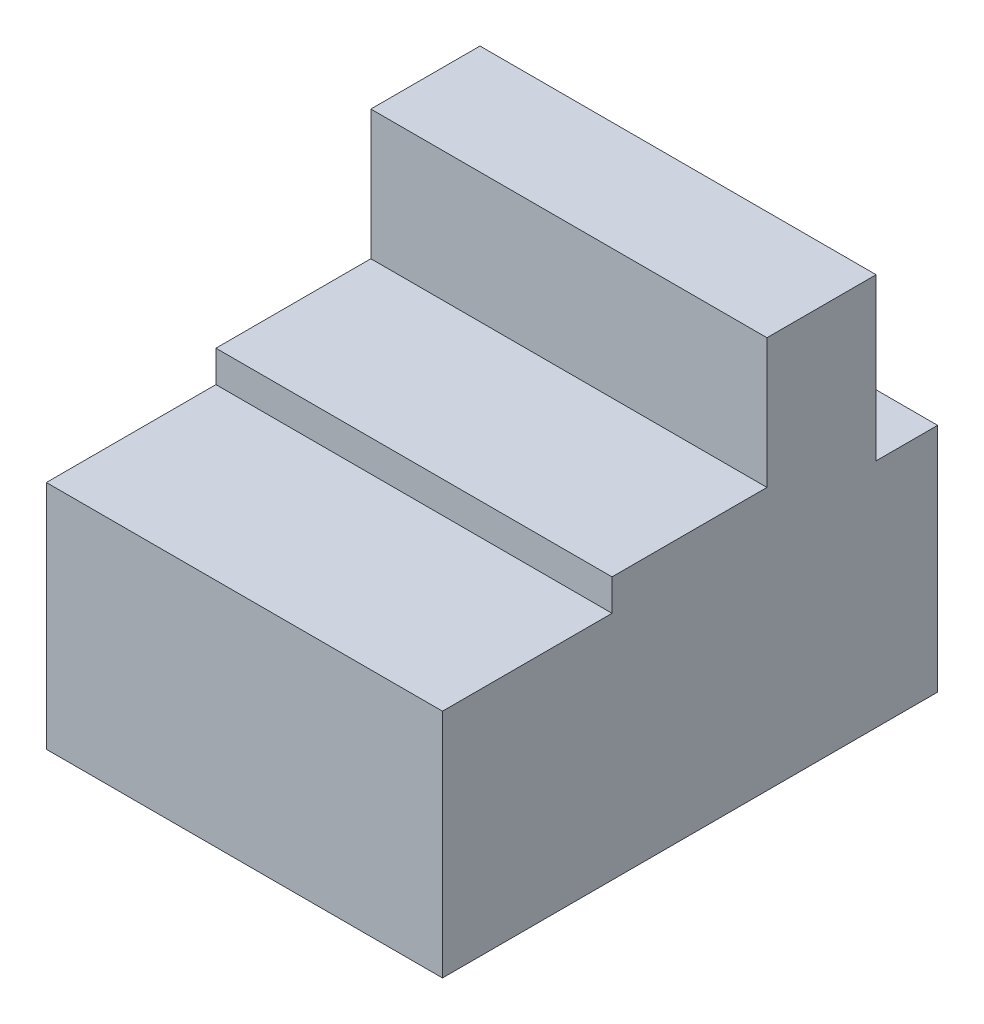
ISO-10303-21;
HEADER;
FILE_DESCRIPTION(('STEP AP214'),'2;1');
FILE_NAME('part.step','',(''),(''),'','','');
FILE_SCHEMA(('AUTOMOTIVE_DESIGN { 1 0 10303 214 1 1 1 1 }'));
ENDSEC;
DATA;
#1=APPLICATION_CONTEXT('core data for automotive mechanical design processes');
#2=APPLICATION_PROTOCOL_DEFINITION('international standard','automotive_design',2000,#1);
#3=PRODUCT_CONTEXT('',#1,'mechanical');
#4=PRODUCT('Part','Part','',(#3));
#5=PRODUCT_RELATED_PRODUCT_CATEGORY('part','',(#4));
#6=PRODUCT_DEFINITION_FORMATION('','',#4);
#7=PRODUCT_DEFINITION_CONTEXT('part definition',#1,'design');
#8=PRODUCT_DEFINITION('design','',#6,#7);
#9=PRODUCT_DEFINITION_SHAPE('','',#8);
#10=(LENGTH_UNIT() NAMED_UNIT(*) SI_UNIT(.MILLI.,.METRE.));
#11=(NAMED_UNIT(*) PLANE_ANGLE_UNIT() SI_UNIT($,.RADIAN.));
#12=(NAMED_UNIT(*) SI_UNIT($,.STERADIAN.) SOLID_ANGLE_UNIT());
#13=UNCERTAINTY_MEASURE_WITH_UNIT(LENGTH_MEASURE(1.E-05),#10,'distance_accuracy_value','');
#14=(GEOMETRIC_REPRESENTATION_CONTEXT(3) GLOBAL_UNCERTAINTY_ASSIGNED_CONTEXT((#13)) GLOBAL_UNIT_ASSIGNED_CONTEXT((#10,
#11,#12)) REPRESENTATION_CONTEXT('',''));
#15=CARTESIAN_POINT('',(0.,0.,0.));
#16=DIRECTION('',(0.,0.,1.));
#17=DIRECTION('',(1.,0.,0.));
#18=AXIS2_PLACEMENT_3D('',#15,#16,#17);
#19=CARTESIAN_POINT('',(0.,88.9,0.));
#20=DIRECTION('',(0.,1.,0.));
#21=DIRECTION('',(0.,0.,1.));
#22=AXIS2_PLACEMENT_3D('',#19,#20,#21);
#23=PLANE('',#22);
#24=DIRECTION('',(0.,0.,-1.));
#25=VECTOR('',#24,1.);
#26=CARTESIAN_POINT('',(152.4,88.9,0.));
#27=LINE('',#26,#25);
#28=CARTESIAN_POINT('',(152.4,88.9,0.));
#29=VERTEX_POINT('',#28);
#30=CARTESIAN_POINT('',(152.4,88.9,-65.22974));
#31=VERTEX_POINT('',#30);
#32=EDGE_CURVE('E82',#29,#31,#27,.T.);
#33=ORIENTED_EDGE('',*,*,#32,.T.);
#34=DIRECTION('',(-1.,0.,0.));
#35=VECTOR('',#34,1.);
#36=CARTESIAN_POINT('',(271.434674577446,88.9,-65.22974));
#37=LINE('',#36,#35);
#38=CARTESIAN_POINT('',(0.,88.9,-65.22974));
#39=VERTEX_POINT('',#38);
#40=EDGE_CURVE('E128',#31,#39,#37,.T.);
#41=ORIENTED_EDGE('',*,*,#40,.T.);
#42=DIRECTION('',(0.,0.,-1.));
#43=VECTOR('',#42,1.);
#44=CARTESIAN_POINT('',(0.,88.9,0.));
#45=LINE('',#44,#43);
#46=CARTESIAN_POINT('',(0.,88.9,0.));
#47=VERTEX_POINT('',#46);
#48=EDGE_CURVE('E142',#47,#39,#45,.T.);
#49=ORIENTED_EDGE('',*,*,#48,.F.);
#50=DIRECTION('',(1.,0.,0.));
#51=VECTOR('',#50,1.);
#52=CARTESIAN_POINT('',(0.,88.9,0.));
#53=LINE('',#52,#51);
#54=EDGE_CURVE('E159',#47,#29,#53,.T.);
#55=ORIENTED_EDGE('',*,*,#54,.T.);
#56=EDGE_LOOP('',(#33,#41,#49,#55));
#57=FACE_BOUND('',#56,.T.);
#58=ADVANCED_FACE('F32',(#57),#23,.T.);
#59=CARTESIAN_POINT('',(0.,88.9,0.));
#60=DIRECTION('',(0.,0.,-1.));
#61=DIRECTION('',(-1.,0.,0.));
#62=AXIS2_PLACEMENT_3D('',#59,#60,#61);
#63=PLANE('',#62);
#64=DIRECTION('',(1.,0.,0.));
#65=VECTOR('',#64,1.);
#66=CARTESIAN_POINT('',(0.,0.,0.));
#67=LINE('',#66,#65);
#68=CARTESIAN_POINT('',(0.,0.,0.));
#69=VERTEX_POINT('',#68);
#70=CARTESIAN_POINT('',(152.4,0.,0.));
#71=VERTEX_POINT('',#70);
#72=EDGE_CURVE('E147',#69,#71,#67,.T.);
#73=ORIENTED_EDGE('',*,*,#72,.T.);
#74=DIRECTION('',(0.,-1.,0.));
#75=VECTOR('',#74,1.);
#76=CARTESIAN_POINT('',(152.4,88.9,0.));
#77=LINE('',#76,#75);
#78=EDGE_CURVE('E11',#29,#71,#77,.T.);
#79=ORIENTED_EDGE('',*,*,#78,.F.);
#80=ORIENTED_EDGE('',*,*,#54,.F.);
#81=DIRECTION('',(0.,-1.,0.));
#82=VECTOR('',#81,1.);
#83=CARTESIAN_POINT('',(0.,88.9,0.));
#84=LINE('',#83,#82);
#85=EDGE_CURVE('E56',#47,#69,#84,.T.);
#86=ORIENTED_EDGE('',*,*,#85,.T.);
#87=EDGE_LOOP('',(#73,#79,#80,#86));
#88=FACE_BOUND('',#87,.T.);
#89=ADVANCED_FACE('F34',(#88),#63,.F.);
#90=CARTESIAN_POINT('',(152.4,88.9,0.));
#91=DIRECTION('',(-1.,0.,0.));
#92=DIRECTION('',(0.,0.,1.));
#93=AXIS2_PLACEMENT_3D('',#90,#91,#92);
#94=PLANE('',#93);
#95=DIRECTION('',(0.,0.,-1.));
#96=VECTOR('',#95,1.);
#97=CARTESIAN_POINT('',(152.4,0.,0.));
#98=LINE('',#97,#96);
#99=CARTESIAN_POINT('',(152.4,0.,-190.5));
#100=VERTEX_POINT('',#99);
#101=EDGE_CURVE('E149',#71,#100,#98,.T.);
#102=ORIENTED_EDGE('',*,*,#101,.T.);
#103=DIRECTION('',(0.,-1.,0.));
#104=VECTOR('',#103,1.);
#105=CARTESIAN_POINT('',(152.4,88.9,-190.5));
#106=LINE('',#105,#104);
#107=CARTESIAN_POINT('',(152.4,88.9,-190.5));
#108=VERTEX_POINT('',#107);
#109=EDGE_CURVE('E40',#108,#100,#106,.T.);
#110=ORIENTED_EDGE('',*,*,#109,.F.);
#111=CARTESIAN_POINT('',(152.4,88.9,-166.82974));
#112=VERTEX_POINT('',#111);
#113=EDGE_CURVE('E172',#112,#108,#27,.T.);
#114=ORIENTED_EDGE('',*,*,#113,.F.);
#115=DIRECTION('',(0.,-1.,0.));
#116=VECTOR('',#115,1.);
#117=CARTESIAN_POINT('',(152.4,88.9,-166.82974));
#118=LINE('',#117,#116);
#119=CARTESIAN_POINT('',(152.4,150.92172,-166.82974));
#120=VERTEX_POINT('',#119);
#121=EDGE_CURVE('E124',#120,#112,#118,.T.);
#122=ORIENTED_EDGE('',*,*,#121,.F.);
#123=DIRECTION('',(0.,0.,-1.));
#124=VECTOR('',#123,1.);
#125=CARTESIAN_POINT('',(152.4,150.92172,-166.82974));
#126=LINE('',#125,#124);
#127=CARTESIAN_POINT('',(152.4,150.92172,-124.83338));
#128=VERTEX_POINT('',#127);
#129=EDGE_CURVE('E198',#128,#120,#126,.T.);
#130=ORIENTED_EDGE('',*,*,#129,.F.);
#131=DIRECTION('',(0.,1.,0.));
#132=VECTOR('',#131,1.);
#133=CARTESIAN_POINT('',(152.4,150.92172,-124.83338));
#134=LINE('',#133,#132);
#135=CARTESIAN_POINT('',(152.4,101.0412,-124.83338));
#136=VERTEX_POINT('',#135);
#137=EDGE_CURVE('E196',#136,#128,#134,.T.);
#138=ORIENTED_EDGE('',*,*,#137,.F.);
#139=DIRECTION('',(0.,0.,-1.));
#140=VECTOR('',#139,1.);
#141=CARTESIAN_POINT('',(152.4,101.0412,-124.83338));
#142=LINE('',#141,#140);
#143=CARTESIAN_POINT('',(152.4,101.0412,-65.22974));
#144=VERTEX_POINT('',#143);
#145=EDGE_CURVE('E194',#144,#136,#142,.T.);
#146=ORIENTED_EDGE('',*,*,#145,.F.);
#147=DIRECTION('',(0.,1.,0.));
#148=VECTOR('',#147,1.);
#149=CARTESIAN_POINT('',(152.4,101.0412,-65.22974));
#150=LINE('',#149,#148);
#151=EDGE_CURVE('E150',#31,#144,#150,.T.);
#152=ORIENTED_EDGE('',*,*,#151,.F.);
#153=ORIENTED_EDGE('',*,*,#32,.F.);
#154=ORIENTED_EDGE('',*,*,#78,.T.);
#155=EDGE_LOOP('',(#102,#110,#114,#122,#130,#138,#146,#152,#153,#154));
#156=FACE_BOUND('',#155,.T.);
#157=ADVANCED_FACE('F166',(#156),#94,.F.);
#158=CARTESIAN_POINT('',(0.,88.9,-190.5));
#159=DIRECTION('',(0.,0.,-1.));
#160=DIRECTION('',(-1.,0.,0.));
#161=AXIS2_PLACEMENT_3D('',#158,#159,#160);
#162=PLANE('',#161);
#163=DIRECTION('',(1.,0.,0.));
#164=VECTOR('',#163,1.);
#165=CARTESIAN_POINT('',(0.,0.,-190.5));
#166=LINE('',#165,#164);
#167=CARTESIAN_POINT('',(0.,0.,-190.5));
#168=VERTEX_POINT('',#167);
#169=EDGE_CURVE('E153',#168,#100,#166,.T.);
#170=ORIENTED_EDGE('',*,*,#169,.F.);
#171=DIRECTION('',(0.,-1.,0.));
#172=VECTOR('',#171,1.);
#173=CARTESIAN_POINT('',(0.,88.9,-190.5));
#174=LINE('',#173,#172);
#175=CARTESIAN_POINT('',(0.,88.9,-190.5));
#176=VERTEX_POINT('',#175);
#177=EDGE_CURVE('E161',#176,#168,#174,.T.);
#178=ORIENTED_EDGE('',*,*,#177,.F.);
#179=DIRECTION('',(1.,0.,0.));
#180=VECTOR('',#179,1.);
#181=CARTESIAN_POINT('',(0.,88.9,-190.5));
#182=LINE('',#181,#180);
#183=EDGE_CURVE('E141',#176,#108,#182,.T.);
#184=ORIENTED_EDGE('',*,*,#183,.T.);
#185=ORIENTED_EDGE('',*,*,#109,.T.);
#186=EDGE_LOOP('',(#170,#178,#184,#185));
#187=FACE_BOUND('',#186,.T.);
#188=ADVANCED_FACE('F165',(#187),#162,.T.);
#189=CARTESIAN_POINT('',(0.,88.9,0.));
#190=DIRECTION('',(-1.,0.,0.));
#191=DIRECTION('',(0.,0.,1.));
#192=AXIS2_PLACEMENT_3D('',#189,#190,#191);
#193=PLANE('',#192);
#194=DIRECTION('',(0.,0.,-1.));
#195=VECTOR('',#194,1.);
#196=CARTESIAN_POINT('',(0.,0.,0.));
#197=LINE('',#196,#195);
#198=EDGE_CURVE('E156',#69,#168,#197,.T.);
#199=ORIENTED_EDGE('',*,*,#198,.F.);
#200=ORIENTED_EDGE('',*,*,#85,.F.);
#201=ORIENTED_EDGE('',*,*,#48,.T.);
#202=DIRECTION('',(0.,-1.,0.));
#203=VECTOR('',#202,1.);
#204=CARTESIAN_POINT('',(0.,101.0412,-65.22974));
#205=LINE('',#204,#203);
#206=CARTESIAN_POINT('',(0.,101.0412,-65.22974));
#207=VERTEX_POINT('',#206);
#208=EDGE_CURVE('E47',#207,#39,#205,.T.);
#209=ORIENTED_EDGE('',*,*,#208,.F.);
#210=DIRECTION('',(0.,0.,1.));
#211=VECTOR('',#210,1.);
#212=CARTESIAN_POINT('',(0.,101.0412,-124.83338));
#213=LINE('',#212,#211);
#214=CARTESIAN_POINT('',(0.,101.0412,-124.83338));
#215=VERTEX_POINT('',#214);
#216=EDGE_CURVE('E176',#215,#207,#213,.T.);
#217=ORIENTED_EDGE('',*,*,#216,.F.);
#218=DIRECTION('',(0.,-1.,0.));
#219=VECTOR('',#218,1.);
#220=CARTESIAN_POINT('',(0.,150.92172,-124.83338));
#221=LINE('',#220,#219);
#222=CARTESIAN_POINT('',(0.,150.92172,-124.83338));
#223=VERTEX_POINT('',#222);
#224=EDGE_CURVE('E182',#223,#215,#221,.T.);
#225=ORIENTED_EDGE('',*,*,#224,.F.);
#226=DIRECTION('',(0.,0.,1.));
#227=VECTOR('',#226,1.);
#228=CARTESIAN_POINT('',(0.,150.92172,-166.82974));
#229=LINE('',#228,#227);
#230=CARTESIAN_POINT('',(0.,150.92172,-166.82974));
#231=VERTEX_POINT('',#230);
#232=EDGE_CURVE('E136',#231,#223,#229,.T.);
#233=ORIENTED_EDGE('',*,*,#232,.F.);
#234=DIRECTION('',(0.,1.,0.));
#235=VECTOR('',#234,1.);
#236=CARTESIAN_POINT('',(0.,88.9,-166.82974));
#237=LINE('',#236,#235);
#238=CARTESIAN_POINT('',(0.,88.9,-166.82974));
#239=VERTEX_POINT('',#238);
#240=EDGE_CURVE('E122',#239,#231,#237,.T.);
#241=ORIENTED_EDGE('',*,*,#240,.F.);
#242=EDGE_CURVE('E132',#239,#176,#45,.T.);
#243=ORIENTED_EDGE('',*,*,#242,.T.);
#244=ORIENTED_EDGE('',*,*,#177,.T.);
#245=EDGE_LOOP('',(#199,#200,#201,#209,#217,#225,#233,#241,#243,#244));
#246=FACE_BOUND('',#245,.T.);
#247=ADVANCED_FACE('F131',(#246),#193,.T.);
#248=DIRECTION('',(-1.,0.,0.));
#249=VECTOR('',#248,1.);
#250=CARTESIAN_POINT('',(271.434674577446,88.9,-166.82974));
#251=LINE('',#250,#249);
#252=EDGE_CURVE('E118',#112,#239,#251,.T.);
#253=ORIENTED_EDGE('',*,*,#252,.F.);
#254=ORIENTED_EDGE('',*,*,#113,.T.);
#255=ORIENTED_EDGE('',*,*,#183,.F.);
#256=ORIENTED_EDGE('',*,*,#242,.F.);
#257=EDGE_LOOP('',(#253,#254,#255,#256));
#258=FACE_BOUND('',#257,.T.);
#259=ADVANCED_FACE('F139',(#258),#23,.T.);
#260=CARTESIAN_POINT('',(0.,0.,0.));
#261=DIRECTION('',(0.,1.,0.));
#262=DIRECTION('',(0.,0.,1.));
#263=AXIS2_PLACEMENT_3D('',#260,#261,#262);
#264=PLANE('',#263);
#265=ORIENTED_EDGE('',*,*,#72,.F.);
#266=ORIENTED_EDGE('',*,*,#198,.T.);
#267=ORIENTED_EDGE('',*,*,#169,.T.);
#268=ORIENTED_EDGE('',*,*,#101,.F.);
#269=EDGE_LOOP('',(#265,#266,#267,#268));
#270=FACE_BOUND('',#269,.T.);
#271=ADVANCED_FACE('F169',(#270),#264,.F.);
#272=CARTESIAN_POINT('',(271.434674577446,101.0412,-124.83338));
#273=DIRECTION('',(0.,-1.,0.));
#274=DIRECTION('',(0.,0.,-1.));
#275=AXIS2_PLACEMENT_3D('',#272,#273,#274);
#276=PLANE('',#275);
#277=DIRECTION('',(-1.,0.,0.));
#278=VECTOR('',#277,1.);
#279=CARTESIAN_POINT('',(271.434674577446,101.0412,-65.22974));
#280=LINE('',#279,#278);
#281=EDGE_CURVE('E186',#144,#207,#280,.T.);
#282=ORIENTED_EDGE('',*,*,#281,.F.);
#283=ORIENTED_EDGE('',*,*,#145,.T.);
#284=DIRECTION('',(-1.,0.,0.));
#285=VECTOR('',#284,1.);
#286=CARTESIAN_POINT('',(271.434674577446,101.0412,-124.83338));
#287=LINE('',#286,#285);
#288=EDGE_CURVE('E188',#136,#215,#287,.T.);
#289=ORIENTED_EDGE('',*,*,#288,.T.);
#290=ORIENTED_EDGE('',*,*,#216,.T.);
#291=EDGE_LOOP('',(#282,#283,#289,#290));
#292=FACE_BOUND('',#291,.T.);
#293=ADVANCED_FACE('F212',(#292),#276,.F.);
#294=CARTESIAN_POINT('',(271.434674577446,150.92172,-124.83338));
#295=DIRECTION('',(0.,0.,-1.));
#296=DIRECTION('',(-1.,0.,0.));
#297=AXIS2_PLACEMENT_3D('',#294,#295,#296);
#298=PLANE('',#297);
#299=ORIENTED_EDGE('',*,*,#288,.F.);
#300=ORIENTED_EDGE('',*,*,#137,.T.);
#301=DIRECTION('',(-1.,0.,0.));
#302=VECTOR('',#301,1.);
#303=CARTESIAN_POINT('',(271.434674577446,150.92172,-124.83338));
#304=LINE('',#303,#302);
#305=EDGE_CURVE('E190',#128,#223,#304,.T.);
#306=ORIENTED_EDGE('',*,*,#305,.T.);
#307=ORIENTED_EDGE('',*,*,#224,.T.);
#308=EDGE_LOOP('',(#299,#300,#306,#307));
#309=FACE_BOUND('',#308,.T.);
#310=ADVANCED_FACE('F207',(#309),#298,.F.);
#311=CARTESIAN_POINT('',(271.434674577446,150.92172,-166.82974));
#312=DIRECTION('',(0.,-1.,0.));
#313=DIRECTION('',(0.,0.,-1.));
#314=AXIS2_PLACEMENT_3D('',#311,#312,#313);
#315=PLANE('',#314);
#316=ORIENTED_EDGE('',*,*,#305,.F.);
#317=ORIENTED_EDGE('',*,*,#129,.T.);
#318=DIRECTION('',(-1.,0.,0.));
#319=VECTOR('',#318,1.);
#320=CARTESIAN_POINT('',(271.434674577446,150.92172,-166.82974));
#321=LINE('',#320,#319);
#322=EDGE_CURVE('E129',#120,#231,#321,.T.);
#323=ORIENTED_EDGE('',*,*,#322,.T.);
#324=ORIENTED_EDGE('',*,*,#232,.T.);
#325=EDGE_LOOP('',(#316,#317,#323,#324));
#326=FACE_BOUND('',#325,.T.);
#327=ADVANCED_FACE('F201',(#326),#315,.F.);
#328=CARTESIAN_POINT('',(271.434674577446,88.9,-166.82974));
#329=DIRECTION('',(0.,0.,1.));
#330=DIRECTION('',(1.,0.,0.));
#331=AXIS2_PLACEMENT_3D('',#328,#329,#330);
#332=PLANE('',#331);
#333=ORIENTED_EDGE('',*,*,#322,.F.);
#334=ORIENTED_EDGE('',*,*,#121,.T.);
#335=ORIENTED_EDGE('',*,*,#252,.T.);
#336=ORIENTED_EDGE('',*,*,#240,.T.);
#337=EDGE_LOOP('',(#333,#334,#335,#336));
#338=FACE_BOUND('',#337,.T.);
#339=ADVANCED_FACE('F121',(#338),#332,.F.);
#340=CARTESIAN_POINT('',(271.434674577446,101.0412,-65.22974));
#341=DIRECTION('',(0.,0.,-1.));
#342=DIRECTION('',(-1.,0.,0.));
#343=AXIS2_PLACEMENT_3D('',#340,#341,#342);
#344=PLANE('',#343);
#345=ORIENTED_EDGE('',*,*,#40,.F.);
#346=ORIENTED_EDGE('',*,*,#151,.T.);
#347=ORIENTED_EDGE('',*,*,#281,.T.);
#348=ORIENTED_EDGE('',*,*,#208,.T.);
#349=EDGE_LOOP('',(#345,#346,#347,#348));
#350=FACE_BOUND('',#349,.T.);
#351=ADVANCED_FACE('F211',(#350),#344,.F.);
#352=CLOSED_SHELL('',(#58,#89,#157,#188,#247,#259,#271,#293,#310,#327,#339,#351));
#353=MANIFOLD_SOLID_BREP('B2',#352);
#354=ADVANCED_BREP_SHAPE_REPRESENTATION('',(#18,#353),#14);
#355=SHAPE_DEFINITION_REPRESENTATION(#9,#354);
ENDSEC;
END-ISO-10303-21;
